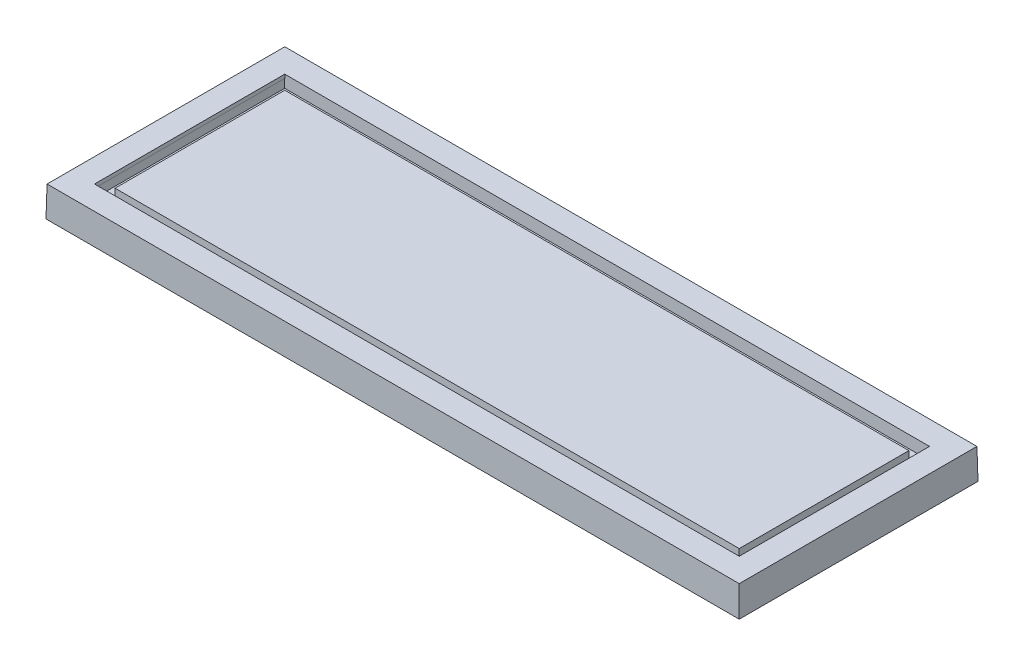
ISO-10303-21;
HEADER;
FILE_DESCRIPTION(('STEP AP214'),'2;1');
FILE_NAME('part.step','',(''),(''),'','','');
FILE_SCHEMA(('AUTOMOTIVE_DESIGN { 1 0 10303 214 1 1 1 1 }'));
ENDSEC;
DATA;
#1=APPLICATION_CONTEXT('core data for automotive mechanical design processes');
#2=APPLICATION_PROTOCOL_DEFINITION('international standard','automotive_design',2000,#1);
#3=PRODUCT_CONTEXT('',#1,'mechanical');
#4=PRODUCT('Part','Part','',(#3));
#5=PRODUCT_RELATED_PRODUCT_CATEGORY('part','',(#4));
#6=PRODUCT_DEFINITION_FORMATION('','',#4);
#7=PRODUCT_DEFINITION_CONTEXT('part definition',#1,'design');
#8=PRODUCT_DEFINITION('design','',#6,#7);
#9=PRODUCT_DEFINITION_SHAPE('','',#8);
#10=(LENGTH_UNIT() NAMED_UNIT(*) SI_UNIT(.MILLI.,.METRE.));
#11=(NAMED_UNIT(*) PLANE_ANGLE_UNIT() SI_UNIT($,.RADIAN.));
#12=(NAMED_UNIT(*) SI_UNIT($,.STERADIAN.) SOLID_ANGLE_UNIT());
#13=UNCERTAINTY_MEASURE_WITH_UNIT(LENGTH_MEASURE(1.E-05),#10,'distance_accuracy_value','');
#14=(GEOMETRIC_REPRESENTATION_CONTEXT(3) GLOBAL_UNCERTAINTY_ASSIGNED_CONTEXT((#13)) GLOBAL_UNIT_ASSIGNED_CONTEXT((#10,
#11,#12)) REPRESENTATION_CONTEXT('',''));
#15=CARTESIAN_POINT('',(0.,0.,0.));
#16=DIRECTION('',(0.,0.,1.));
#17=DIRECTION('',(1.,0.,0.));
#18=AXIS2_PLACEMENT_3D('',#15,#16,#17);
#19=CARTESIAN_POINT('',(286.,0.,98.5));
#20=DIRECTION('',(0.999847695156391,0.0174524064372835,0.));
#21=DIRECTION('',(-0.0174524064372836,0.999847695156391,0.));
#22=AXIS2_PLACEMENT_3D('',#19,#20,#21);
#23=PLANE('',#22);
#24=DIRECTION('',(0.,0.,-1.));
#25=VECTOR('',#24,1.);
#26=CARTESIAN_POINT('',(286.,0.,98.5));
#27=LINE('',#26,#25);
#28=CARTESIAN_POINT('',(286.,0.,98.5));
#29=VERTEX_POINT('',#28);
#30=CARTESIAN_POINT('',(286.,0.,-98.5));
#31=VERTEX_POINT('',#30);
#32=EDGE_CURVE('E243',#29,#31,#27,.T.);
#33=ORIENTED_EDGE('',*,*,#32,.T.);
#34=DIRECTION('',(0.0174497491606827,-0.999695459881888,-0.0174497491606827));
#35=VECTOR('',#34,1.);
#36=CARTESIAN_POINT('',(285.825829577419,9.97821682687104,-98.3258295774191));
#37=LINE('',#36,#35);
#38=CARTESIAN_POINT('',(285.563623376795,25.,-98.0636233767945));
#39=VERTEX_POINT('',#38);
#40=EDGE_CURVE('E11',#39,#31,#37,.T.);
#41=ORIENTED_EDGE('',*,*,#40,.F.);
#42=DIRECTION('',(0.,0.,1.));
#43=VECTOR('',#42,1.);
#44=CARTESIAN_POINT('',(285.563623376795,25.,0.));
#45=LINE('',#44,#43);
#46=CARTESIAN_POINT('',(285.563623376795,25.,98.0636233767946));
#47=VERTEX_POINT('',#46);
#48=EDGE_CURVE('E260',#47,#39,#45,.F.);
#49=ORIENTED_EDGE('',*,*,#48,.F.);
#50=DIRECTION('',(0.0174497491606827,-0.999695459881888,0.0174497491606827));
#51=VECTOR('',#50,1.);
#52=CARTESIAN_POINT('',(286.,0.,98.5));
#53=LINE('',#52,#51);
#54=EDGE_CURVE('E262',#47,#29,#53,.T.);
#55=ORIENTED_EDGE('',*,*,#54,.T.);
#56=EDGE_LOOP('',(#33,#41,#49,#55));
#57=FACE_BOUND('',#56,.T.);
#58=ADVANCED_FACE('F39',(#57),#23,.T.);
#59=CARTESIAN_POINT('',(-286.,0.,-98.5));
#60=DIRECTION('',(0.,0.0174524064372835,-0.999847695156391));
#61=DIRECTION('',(0.,0.999847695156391,0.0174524064372835));
#62=AXIS2_PLACEMENT_3D('',#59,#60,#61);
#63=PLANE('',#62);
#64=DIRECTION('',(-1.,0.,0.));
#65=VECTOR('',#64,1.);
#66=CARTESIAN_POINT('',(-286.,0.,-98.5));
#67=LINE('',#66,#65);
#68=CARTESIAN_POINT('',(-286.,0.,-98.5));
#69=VERTEX_POINT('',#68);
#70=EDGE_CURVE('E255',#31,#69,#67,.T.);
#71=ORIENTED_EDGE('',*,*,#70,.T.);
#72=DIRECTION('',(-0.0174497491606827,-0.999695459881888,-0.0174497491606827));
#73=VECTOR('',#72,1.);
#74=CARTESIAN_POINT('',(-285.940014732083,3.43655369736642,-98.4400147320831));
#75=LINE('',#74,#73);
#76=CARTESIAN_POINT('',(-285.563623376795,25.,-98.0636233767945));
#77=VERTEX_POINT('',#76);
#78=EDGE_CURVE('E48',#77,#69,#75,.T.);
#79=ORIENTED_EDGE('',*,*,#78,.F.);
#80=DIRECTION('',(1.,0.,0.));
#81=VECTOR('',#80,1.);
#82=CARTESIAN_POINT('',(0.,25.,-98.0636233767945));
#83=LINE('',#82,#81);
#84=EDGE_CURVE('E272',#39,#77,#83,.F.);
#85=ORIENTED_EDGE('',*,*,#84,.F.);
#86=ORIENTED_EDGE('',*,*,#40,.T.);
#87=EDGE_LOOP('',(#71,#79,#85,#86));
#88=FACE_BOUND('',#87,.T.);
#89=ADVANCED_FACE('F41',(#88),#63,.T.);
#90=CARTESIAN_POINT('',(-286.,0.,98.5));
#91=DIRECTION('',(-0.999847695156391,0.0174524064372835,0.));
#92=DIRECTION('',(-0.0174524064372836,-0.999847695156391,0.));
#93=AXIS2_PLACEMENT_3D('',#90,#91,#92);
#94=PLANE('',#93);
#95=DIRECTION('',(0.,0.,1.));
#96=VECTOR('',#95,1.);
#97=CARTESIAN_POINT('',(-286.,0.,98.5));
#98=LINE('',#97,#96);
#99=CARTESIAN_POINT('',(-286.,0.,98.5));
#100=VERTEX_POINT('',#99);
#101=EDGE_CURVE('E257',#69,#100,#98,.T.);
#102=ORIENTED_EDGE('',*,*,#101,.T.);
#103=DIRECTION('',(-0.0174497491606827,-0.999695459881888,0.0174497491606827));
#104=VECTOR('',#103,1.);
#105=CARTESIAN_POINT('',(-286.,0.,98.5));
#106=LINE('',#105,#104);
#107=CARTESIAN_POINT('',(-285.563623376795,25.,98.0636233767946));
#108=VERTEX_POINT('',#107);
#109=EDGE_CURVE('E265',#108,#100,#106,.T.);
#110=ORIENTED_EDGE('',*,*,#109,.F.);
#111=DIRECTION('',(0.,0.,-1.));
#112=VECTOR('',#111,1.);
#113=CARTESIAN_POINT('',(-285.563623376795,25.,0.));
#114=LINE('',#113,#112);
#115=EDGE_CURVE('E273',#77,#108,#114,.F.);
#116=ORIENTED_EDGE('',*,*,#115,.F.);
#117=ORIENTED_EDGE('',*,*,#78,.T.);
#118=EDGE_LOOP('',(#102,#110,#116,#117));
#119=FACE_BOUND('',#118,.T.);
#120=ADVANCED_FACE('F291',(#119),#94,.T.);
#121=CARTESIAN_POINT('',(-286.,0.,98.5));
#122=DIRECTION('',(0.,0.0174524064372835,0.999847695156391));
#123=DIRECTION('',(0.,-0.999847695156391,0.0174524064372835));
#124=AXIS2_PLACEMENT_3D('',#121,#122,#123);
#125=PLANE('',#124);
#126=DIRECTION('',(1.,0.,0.));
#127=VECTOR('',#126,1.);
#128=CARTESIAN_POINT('',(-286.,0.,98.5));
#129=LINE('',#128,#127);
#130=EDGE_CURVE('E259',#100,#29,#129,.T.);
#131=ORIENTED_EDGE('',*,*,#130,.T.);
#132=ORIENTED_EDGE('',*,*,#54,.F.);
#133=DIRECTION('',(-1.,0.,0.));
#134=VECTOR('',#133,1.);
#135=CARTESIAN_POINT('',(0.,25.,98.0636233767946));
#136=LINE('',#135,#134);
#137=EDGE_CURVE('E43',#108,#47,#136,.F.);
#138=ORIENTED_EDGE('',*,*,#137,.F.);
#139=ORIENTED_EDGE('',*,*,#109,.T.);
#140=EDGE_LOOP('',(#131,#132,#138,#139));
#141=FACE_BOUND('',#140,.T.);
#142=ADVANCED_FACE('F283',(#141),#125,.T.);
#143=CARTESIAN_POINT('',(0.,25.,0.));
#144=DIRECTION('',(0.,-1.,0.));
#145=DIRECTION('',(0.,0.,-1.));
#146=AXIS2_PLACEMENT_3D('',#143,#144,#145);
#147=PLANE('',#146);
#148=DIRECTION('',(-1.,0.,0.));
#149=VECTOR('',#148,1.);
#150=CARTESIAN_POINT('',(-266.,25.,-78.5));
#151=LINE('',#150,#149);
#152=CARTESIAN_POINT('',(266.,25.,-78.5));
#153=VERTEX_POINT('',#152);
#154=CARTESIAN_POINT('',(-266.,25.,-78.5));
#155=VERTEX_POINT('',#154);
#156=EDGE_CURVE('E231',#153,#155,#151,.T.);
#157=ORIENTED_EDGE('',*,*,#156,.F.);
#158=DIRECTION('',(0.,0.,-1.));
#159=VECTOR('',#158,1.);
#160=CARTESIAN_POINT('',(266.,25.,78.5));
#161=LINE('',#160,#159);
#162=CARTESIAN_POINT('',(266.,25.,78.5));
#163=VERTEX_POINT('',#162);
#164=EDGE_CURVE('E64',#163,#153,#161,.T.);
#165=ORIENTED_EDGE('',*,*,#164,.F.);
#166=DIRECTION('',(1.,0.,0.));
#167=VECTOR('',#166,1.);
#168=CARTESIAN_POINT('',(-266.,25.,78.5));
#169=LINE('',#168,#167);
#170=CARTESIAN_POINT('',(-266.,25.,78.5));
#171=VERTEX_POINT('',#170);
#172=EDGE_CURVE('E237',#171,#163,#169,.T.);
#173=ORIENTED_EDGE('',*,*,#172,.F.);
#174=DIRECTION('',(0.,0.,1.));
#175=VECTOR('',#174,1.);
#176=CARTESIAN_POINT('',(-266.,25.,78.5));
#177=LINE('',#176,#175);
#178=EDGE_CURVE('E234',#155,#171,#177,.T.);
#179=ORIENTED_EDGE('',*,*,#178,.F.);
#180=EDGE_LOOP('',(#157,#165,#173,#179));
#181=FACE_BOUND('',#180,.T.);
#182=ORIENTED_EDGE('',*,*,#48,.T.);
#183=ORIENTED_EDGE('',*,*,#84,.T.);
#184=ORIENTED_EDGE('',*,*,#115,.T.);
#185=ORIENTED_EDGE('',*,*,#137,.T.);
#186=EDGE_LOOP('',(#182,#183,#184,#185));
#187=FACE_BOUND('',#186,.T.);
#188=ADVANCED_FACE('F279',(#181,#187),#147,.F.);
#189=CARTESIAN_POINT('',(0.,0.,0.));
#190=DIRECTION('',(0.,-1.,0.));
#191=DIRECTION('',(0.,0.,-1.));
#192=AXIS2_PLACEMENT_3D('',#189,#190,#191);
#193=PLANE('',#192);
#194=ORIENTED_EDGE('',*,*,#32,.F.);
#195=ORIENTED_EDGE('',*,*,#130,.F.);
#196=ORIENTED_EDGE('',*,*,#101,.F.);
#197=ORIENTED_EDGE('',*,*,#70,.F.);
#198=EDGE_LOOP('',(#194,#195,#196,#197));
#199=FACE_BOUND('',#198,.T.);
#200=ADVANCED_FACE('F293',(#199),#193,.T.);
#201=CARTESIAN_POINT('',(266.,25.,78.5));
#202=DIRECTION('',(0.999847695156391,-0.0174524064372835,0.));
#203=DIRECTION('',(0.0174524064372835,0.999847695156391,0.));
#204=AXIS2_PLACEMENT_3D('',#201,#202,#203);
#205=PLANE('',#204);
#206=ORIENTED_EDGE('',*,*,#164,.T.);
#207=DIRECTION('',(0.0174497491606827,0.999695459881887,-0.0174497491606827));
#208=VECTOR('',#207,1.);
#209=CARTESIAN_POINT('',(265.952194481914,22.2612237031141,-78.452194481914));
#210=LINE('',#209,#208);
#211=CARTESIAN_POINT('',(265.947634805215,22.,-78.4476348052154));
#212=VERTEX_POINT('',#211);
#213=EDGE_CURVE('E245',#212,#153,#210,.T.);
#214=ORIENTED_EDGE('',*,*,#213,.F.);
#215=DIRECTION('',(0.,0.,-1.));
#216=VECTOR('',#215,1.);
#217=CARTESIAN_POINT('',(265.947634805215,22.,78.5));
#218=LINE('',#217,#216);
#219=CARTESIAN_POINT('',(265.947634805215,22.,78.4476348052154));
#220=VERTEX_POINT('',#219);
#221=EDGE_CURVE('E240',#220,#212,#218,.T.);
#222=ORIENTED_EDGE('',*,*,#221,.F.);
#223=DIRECTION('',(0.0174497491606827,0.999695459881887,0.0174497491606827));
#224=VECTOR('',#223,1.);
#225=CARTESIAN_POINT('',(265.83800932725,15.7195605736095,78.3380093272499));
#226=LINE('',#225,#224);
#227=EDGE_CURVE('E241',#220,#163,#226,.T.);
#228=ORIENTED_EDGE('',*,*,#227,.T.);
#229=EDGE_LOOP('',(#206,#214,#222,#228));
#230=FACE_BOUND('',#229,.T.);
#231=ADVANCED_FACE('F295',(#230),#205,.F.);
#232=CARTESIAN_POINT('',(-266.,25.,78.5));
#233=DIRECTION('',(0.,-0.0174524064372835,0.999847695156391));
#234=DIRECTION('',(0.,-0.999847695156391,-0.0174524064372835));
#235=AXIS2_PLACEMENT_3D('',#232,#233,#234);
#236=PLANE('',#235);
#237=ORIENTED_EDGE('',*,*,#172,.T.);
#238=ORIENTED_EDGE('',*,*,#227,.F.);
#239=DIRECTION('',(1.,0.,0.));
#240=VECTOR('',#239,1.);
#241=CARTESIAN_POINT('',(-266.,22.,78.4476348052154));
#242=LINE('',#241,#240);
#243=CARTESIAN_POINT('',(266.,22.,78.4476348052154));
#244=VERTEX_POINT('',#243);
#245=EDGE_CURVE('E193',#220,#244,#242,.T.);
#246=ORIENTED_EDGE('',*,*,#245,.T.);
#247=DIRECTION('',(0.0174497491606827,0.999695459881888,0.0174497491606827));
#248=VECTOR('',#247,1.);
#249=CARTESIAN_POINT('',(265.83800932725,12.7195605736095,78.2856441324653));
#250=LINE('',#249,#248);
#251=CARTESIAN_POINT('',(265.877814545502,15.,78.3254493507178));
#252=VERTEX_POINT('',#251);
#253=EDGE_CURVE('E209',#252,#244,#250,.T.);
#254=ORIENTED_EDGE('',*,*,#253,.F.);
#255=DIRECTION('',(1.,0.,0.));
#256=VECTOR('',#255,1.);
#257=CARTESIAN_POINT('',(-266.,15.,78.3254493507178));
#258=LINE('',#257,#256);
#259=CARTESIAN_POINT('',(-265.877814545503,15.,78.3254493507178));
#260=VERTEX_POINT('',#259);
#261=EDGE_CURVE('E216',#260,#252,#258,.T.);
#262=ORIENTED_EDGE('',*,*,#261,.F.);
#263=DIRECTION('',(-0.0174497491606827,0.999695459881888,0.0174497491606827));
#264=VECTOR('',#263,1.);
#265=CARTESIAN_POINT('',(-266.,22.,78.4476348052154));
#266=LINE('',#265,#264);
#267=CARTESIAN_POINT('',(-266.,22.,78.4476348052154));
#268=VERTEX_POINT('',#267);
#269=EDGE_CURVE('E212',#260,#268,#266,.T.);
#270=ORIENTED_EDGE('',*,*,#269,.T.);
#271=CARTESIAN_POINT('',(-265.947634805215,22.,78.4476348052154));
#272=VERTEX_POINT('',#271);
#273=EDGE_CURVE('E194',#268,#272,#242,.T.);
#274=ORIENTED_EDGE('',*,*,#273,.T.);
#275=DIRECTION('',(-0.0174497491606827,0.999695459881887,0.0174497491606827));
#276=VECTOR('',#275,1.);
#277=CARTESIAN_POINT('',(-266.,25.,78.5));
#278=LINE('',#277,#276);
#279=EDGE_CURVE('E244',#272,#171,#278,.T.);
#280=ORIENTED_EDGE('',*,*,#279,.T.);
#281=EDGE_LOOP('',(#237,#238,#246,#254,#262,#270,#274,#280));
#282=FACE_BOUND('',#281,.T.);
#283=ADVANCED_FACE('F302',(#282),#236,.F.);
#284=CARTESIAN_POINT('',(-266.,25.,78.5));
#285=DIRECTION('',(-0.999847695156391,-0.0174524064372835,0.));
#286=DIRECTION('',(0.0174524064372835,-0.999847695156391,0.));
#287=AXIS2_PLACEMENT_3D('',#284,#285,#286);
#288=PLANE('',#287);
#289=ORIENTED_EDGE('',*,*,#178,.T.);
#290=ORIENTED_EDGE('',*,*,#279,.F.);
#291=DIRECTION('',(0.,0.,1.));
#292=VECTOR('',#291,1.);
#293=CARTESIAN_POINT('',(-265.947634805215,22.,78.5));
#294=LINE('',#293,#292);
#295=CARTESIAN_POINT('',(-265.947634805215,22.,-78.4476348052154));
#296=VERTEX_POINT('',#295);
#297=EDGE_CURVE('E248',#296,#272,#294,.T.);
#298=ORIENTED_EDGE('',*,*,#297,.F.);
#299=DIRECTION('',(-0.0174497491606827,0.999695459881887,-0.0174497491606827));
#300=VECTOR('',#299,1.);
#301=CARTESIAN_POINT('',(-266.,25.,-78.5));
#302=LINE('',#301,#300);
#303=EDGE_CURVE('E247',#296,#155,#302,.T.);
#304=ORIENTED_EDGE('',*,*,#303,.T.);
#305=EDGE_LOOP('',(#289,#290,#298,#304));
#306=FACE_BOUND('',#305,.T.);
#307=ADVANCED_FACE('F349',(#306),#288,.F.);
#308=CARTESIAN_POINT('',(-266.,25.,-78.5));
#309=DIRECTION('',(0.,-0.0174524064372835,-0.999847695156391));
#310=DIRECTION('',(0.,0.999847695156391,-0.0174524064372835));
#311=AXIS2_PLACEMENT_3D('',#308,#309,#310);
#312=PLANE('',#311);
#313=ORIENTED_EDGE('',*,*,#156,.T.);
#314=ORIENTED_EDGE('',*,*,#303,.F.);
#315=DIRECTION('',(-1.,0.,0.));
#316=VECTOR('',#315,1.);
#317=CARTESIAN_POINT('',(-266.,22.,-78.4476348052154));
#318=LINE('',#317,#316);
#319=CARTESIAN_POINT('',(-266.,22.,-78.4476348052154));
#320=VERTEX_POINT('',#319);
#321=EDGE_CURVE('E185',#296,#320,#318,.T.);
#322=ORIENTED_EDGE('',*,*,#321,.T.);
#323=DIRECTION('',(-0.0174497491606827,0.999695459881888,-0.0174497491606827));
#324=VECTOR('',#323,1.);
#325=CARTESIAN_POINT('',(-266.,22.,-78.4476348052154));
#326=LINE('',#325,#324);
#327=CARTESIAN_POINT('',(-265.877814545503,15.,-78.3254493507178));
#328=VERTEX_POINT('',#327);
#329=EDGE_CURVE('E215',#328,#320,#326,.T.);
#330=ORIENTED_EDGE('',*,*,#329,.F.);
#331=DIRECTION('',(-1.,0.,0.));
#332=VECTOR('',#331,1.);
#333=CARTESIAN_POINT('',(-266.,15.,-78.3254493507178));
#334=LINE('',#333,#332);
#335=CARTESIAN_POINT('',(265.877814545502,15.,-78.3254493507178));
#336=VERTEX_POINT('',#335);
#337=EDGE_CURVE('E222',#336,#328,#334,.T.);
#338=ORIENTED_EDGE('',*,*,#337,.F.);
#339=DIRECTION('',(0.0174497491606827,0.999695459881888,-0.0174497491606827));
#340=VECTOR('',#339,1.);
#341=CARTESIAN_POINT('',(265.952226371663,19.2630506655887,-78.3998611768779));
#342=LINE('',#341,#340);
#343=CARTESIAN_POINT('',(266.,22.,-78.4476348052154));
#344=VERTEX_POINT('',#343);
#345=EDGE_CURVE('E213',#336,#344,#342,.T.);
#346=ORIENTED_EDGE('',*,*,#345,.T.);
#347=EDGE_CURVE('E187',#344,#212,#318,.T.);
#348=ORIENTED_EDGE('',*,*,#347,.T.);
#349=ORIENTED_EDGE('',*,*,#213,.T.);
#350=EDGE_LOOP('',(#313,#314,#322,#330,#338,#346,#348,#349));
#351=FACE_BOUND('',#350,.T.);
#352=ADVANCED_FACE('F362',(#351),#312,.F.);
#353=CARTESIAN_POINT('',(0.,22.,0.));
#354=DIRECTION('',(0.,-1.,0.));
#355=DIRECTION('',(0.,0.,-1.));
#356=AXIS2_PLACEMENT_3D('',#353,#354,#355);
#357=PLANE('',#356);
#358=ORIENTED_EDGE('',*,*,#221,.T.);
#359=ORIENTED_EDGE('',*,*,#347,.F.);
#360=DIRECTION('',(0.,0.,-1.));
#361=VECTOR('',#360,1.);
#362=CARTESIAN_POINT('',(266.,22.,78.4476348052154));
#363=LINE('',#362,#361);
#364=EDGE_CURVE('E182',#244,#344,#363,.T.);
#365=ORIENTED_EDGE('',*,*,#364,.F.);
#366=ORIENTED_EDGE('',*,*,#245,.F.);
#367=EDGE_LOOP('',(#358,#359,#365,#366));
#368=FACE_BOUND('',#367,.T.);
#369=ADVANCED_FACE('F371',(#368),#357,.T.);
#370=ORIENTED_EDGE('',*,*,#297,.T.);
#371=ORIENTED_EDGE('',*,*,#273,.F.);
#372=DIRECTION('',(0.,0.,1.));
#373=VECTOR('',#372,1.);
#374=CARTESIAN_POINT('',(-266.,22.,78.4476348052154));
#375=LINE('',#374,#373);
#376=EDGE_CURVE('E190',#320,#268,#375,.T.);
#377=ORIENTED_EDGE('',*,*,#376,.F.);
#378=ORIENTED_EDGE('',*,*,#321,.F.);
#379=EDGE_LOOP('',(#370,#371,#377,#378));
#380=FACE_BOUND('',#379,.T.);
#381=ADVANCED_FACE('F440',(#380),#357,.T.);
#382=CARTESIAN_POINT('',(266.,22.,78.4476348052154));
#383=DIRECTION('',(0.999847695156391,-0.0174524064372835,0.));
#384=DIRECTION('',(0.0174524064372836,0.999847695156391,0.));
#385=AXIS2_PLACEMENT_3D('',#382,#383,#384);
#386=PLANE('',#385);
#387=ORIENTED_EDGE('',*,*,#364,.T.);
#388=ORIENTED_EDGE('',*,*,#345,.F.);
#389=DIRECTION('',(0.,0.,-1.));
#390=VECTOR('',#389,1.);
#391=CARTESIAN_POINT('',(265.877814545502,15.,78.4476348052154));
#392=LINE('',#391,#390);
#393=EDGE_CURVE('E196',#252,#336,#392,.T.);
#394=ORIENTED_EDGE('',*,*,#393,.F.);
#395=ORIENTED_EDGE('',*,*,#253,.T.);
#396=EDGE_LOOP('',(#387,#388,#394,#395));
#397=FACE_BOUND('',#396,.T.);
#398=ADVANCED_FACE('F431',(#397),#386,.F.);
#399=CARTESIAN_POINT('',(-266.,22.,78.4476348052154));
#400=DIRECTION('',(-0.999847695156391,-0.0174524064372835,0.));
#401=DIRECTION('',(0.0174524064372836,-0.999847695156391,0.));
#402=AXIS2_PLACEMENT_3D('',#399,#400,#401);
#403=PLANE('',#402);
#404=ORIENTED_EDGE('',*,*,#376,.T.);
#405=ORIENTED_EDGE('',*,*,#269,.F.);
#406=DIRECTION('',(0.,0.,1.));
#407=VECTOR('',#406,1.);
#408=CARTESIAN_POINT('',(-265.877814545503,15.,78.4476348052154));
#409=LINE('',#408,#407);
#410=EDGE_CURVE('E225',#328,#260,#409,.T.);
#411=ORIENTED_EDGE('',*,*,#410,.F.);
#412=ORIENTED_EDGE('',*,*,#329,.T.);
#413=EDGE_LOOP('',(#404,#405,#411,#412));
#414=FACE_BOUND('',#413,.T.);
#415=ADVANCED_FACE('F422',(#414),#403,.F.);
#416=CARTESIAN_POINT('',(0.,15.,0.));
#417=DIRECTION('',(0.,-1.,0.));
#418=DIRECTION('',(0.,0.,-1.));
#419=AXIS2_PLACEMENT_3D('',#416,#417,#418);
#420=PLANE('',#419);
#421=DIRECTION('',(0.,0.,1.));
#422=VECTOR('',#421,1.);
#423=CARTESIAN_POINT('',(257.622185454498,15.,69.9999999999998));
#424=LINE('',#423,#422);
#425=CARTESIAN_POINT('',(257.622185454498,15.,70.1221854544974));
#426=VERTEX_POINT('',#425);
#427=CARTESIAN_POINT('',(257.622185454498,15.,-70.1221854544975));
#428=VERTEX_POINT('',#427);
#429=EDGE_CURVE('E181',#426,#428,#424,.F.);
#430=ORIENTED_EDGE('',*,*,#429,.F.);
#431=DIRECTION('',(-1.,0.,0.));
#432=VECTOR('',#431,1.);
#433=CARTESIAN_POINT('',(-257.5,15.,70.1221854544976));
#434=LINE('',#433,#432);
#435=CARTESIAN_POINT('',(-257.622185454498,15.,70.1221854544976));
#436=VERTEX_POINT('',#435);
#437=EDGE_CURVE('E199',#436,#426,#434,.F.);
#438=ORIENTED_EDGE('',*,*,#437,.F.);
#439=DIRECTION('',(0.,0.,-1.));
#440=VECTOR('',#439,1.);
#441=CARTESIAN_POINT('',(-257.622185454498,15.,70.));
#442=LINE('',#441,#440);
#443=CARTESIAN_POINT('',(-257.622185454498,15.,-70.1221854544976));
#444=VERTEX_POINT('',#443);
#445=EDGE_CURVE('E203',#444,#436,#442,.F.);
#446=ORIENTED_EDGE('',*,*,#445,.F.);
#447=DIRECTION('',(1.,0.,0.));
#448=VECTOR('',#447,1.);
#449=CARTESIAN_POINT('',(-257.5,15.,-70.1221854544976));
#450=LINE('',#449,#448);
#451=EDGE_CURVE('E163',#428,#444,#450,.F.);
#452=ORIENTED_EDGE('',*,*,#451,.F.);
#453=EDGE_LOOP('',(#430,#438,#446,#452));
#454=FACE_BOUND('',#453,.T.);
#455=ORIENTED_EDGE('',*,*,#393,.T.);
#456=ORIENTED_EDGE('',*,*,#337,.T.);
#457=ORIENTED_EDGE('',*,*,#410,.T.);
#458=ORIENTED_EDGE('',*,*,#261,.T.);
#459=EDGE_LOOP('',(#455,#456,#457,#458));
#460=FACE_BOUND('',#459,.T.);
#461=ADVANCED_FACE('F413',(#454,#460),#420,.F.);
#462=CARTESIAN_POINT('',(257.5,22.,69.9999999999998));
#463=DIRECTION('',(-0.999847695156391,-0.0174524064372835,0.));
#464=DIRECTION('',(0.0174524064372835,-0.999847695156391,0.));
#465=AXIS2_PLACEMENT_3D('',#462,#463,#464);
#466=PLANE('',#465);
#467=DIRECTION('',(0.,0.,-1.));
#468=VECTOR('',#467,1.);
#469=CARTESIAN_POINT('',(257.5,22.,69.9999999999998));
#470=LINE('',#469,#468);
#471=CARTESIAN_POINT('',(257.5,22.,69.9999999999998));
#472=VERTEX_POINT('',#471);
#473=CARTESIAN_POINT('',(257.5,22.,-70.));
#474=VERTEX_POINT('',#473);
#475=EDGE_CURVE('E176',#472,#474,#470,.T.);
#476=ORIENTED_EDGE('',*,*,#475,.F.);
#477=DIRECTION('',(-0.0174497491606827,0.999695459881887,-0.0174497491606827));
#478=VECTOR('',#477,1.);
#479=CARTESIAN_POINT('',(257.343185720928,30.9838840311863,69.8431857209279));
#480=LINE('',#479,#478);
#481=EDGE_CURVE('E186',#426,#472,#480,.T.);
#482=ORIENTED_EDGE('',*,*,#481,.F.);
#483=ORIENTED_EDGE('',*,*,#429,.T.);
#484=DIRECTION('',(-0.0174497491606827,0.999695459881887,0.0174497491606827));
#485=VECTOR('',#484,1.);
#486=CARTESIAN_POINT('',(257.457370875592,24.4422209016817,-69.9573708755921));
#487=LINE('',#486,#485);
#488=EDGE_CURVE('E167',#428,#474,#487,.T.);
#489=ORIENTED_EDGE('',*,*,#488,.T.);
#490=EDGE_LOOP('',(#476,#482,#483,#489));
#491=FACE_BOUND('',#490,.T.);
#492=ADVANCED_FACE('F405',(#491),#466,.F.);
#493=CARTESIAN_POINT('',(-257.5,22.,70.));
#494=DIRECTION('',(0.,-0.0174524064372835,-0.999847695156391));
#495=DIRECTION('',(0.,0.999847695156391,-0.0174524064372835));
#496=AXIS2_PLACEMENT_3D('',#493,#494,#495);
#497=PLANE('',#496);
#498=DIRECTION('',(1.,0.,0.));
#499=VECTOR('',#498,1.);
#500=CARTESIAN_POINT('',(-257.5,22.,70.));
#501=LINE('',#500,#499);
#502=CARTESIAN_POINT('',(-257.5,22.,70.));
#503=VERTEX_POINT('',#502);
#504=EDGE_CURVE('E56',#503,#472,#501,.T.);
#505=ORIENTED_EDGE('',*,*,#504,.F.);
#506=DIRECTION('',(0.0174497491606827,0.999695459881887,-0.0174497491606827));
#507=VECTOR('',#506,1.);
#508=CARTESIAN_POINT('',(-257.5,22.,70.));
#509=LINE('',#508,#507);
#510=EDGE_CURVE('E166',#436,#503,#509,.T.);
#511=ORIENTED_EDGE('',*,*,#510,.F.);
#512=ORIENTED_EDGE('',*,*,#437,.T.);
#513=ORIENTED_EDGE('',*,*,#481,.T.);
#514=EDGE_LOOP('',(#505,#511,#512,#513));
#515=FACE_BOUND('',#514,.T.);
#516=ADVANCED_FACE('F397',(#515),#497,.F.);
#517=CARTESIAN_POINT('',(-257.5,22.,70.));
#518=DIRECTION('',(0.999847695156391,-0.0174524064372835,0.));
#519=DIRECTION('',(0.0174524064372835,0.999847695156391,0.));
#520=AXIS2_PLACEMENT_3D('',#517,#518,#519);
#521=PLANE('',#520);
#522=DIRECTION('',(0.,0.,1.));
#523=VECTOR('',#522,1.);
#524=CARTESIAN_POINT('',(-257.5,22.,70.));
#525=LINE('',#524,#523);
#526=CARTESIAN_POINT('',(-257.5,22.,-70.));
#527=VERTEX_POINT('',#526);
#528=EDGE_CURVE('E170',#527,#503,#525,.T.);
#529=ORIENTED_EDGE('',*,*,#528,.F.);
#530=DIRECTION('',(0.0174497491606827,0.999695459881887,0.0174497491606827));
#531=VECTOR('',#530,1.);
#532=CARTESIAN_POINT('',(-257.5,22.,-70.));
#533=LINE('',#532,#531);
#534=EDGE_CURVE('E156',#444,#527,#533,.T.);
#535=ORIENTED_EDGE('',*,*,#534,.F.);
#536=ORIENTED_EDGE('',*,*,#445,.T.);
#537=ORIENTED_EDGE('',*,*,#510,.T.);
#538=EDGE_LOOP('',(#529,#535,#536,#537));
#539=FACE_BOUND('',#538,.T.);
#540=ADVANCED_FACE('F171',(#539),#521,.F.);
#541=CARTESIAN_POINT('',(-257.5,22.,-70.));
#542=DIRECTION('',(0.,-0.0174524064372835,0.999847695156391));
#543=DIRECTION('',(0.,-0.999847695156391,-0.0174524064372835));
#544=AXIS2_PLACEMENT_3D('',#541,#542,#543);
#545=PLANE('',#544);
#546=DIRECTION('',(-1.,0.,0.));
#547=VECTOR('',#546,1.);
#548=CARTESIAN_POINT('',(-257.5,22.,-70.));
#549=LINE('',#548,#547);
#550=EDGE_CURVE('E160',#474,#527,#549,.T.);
#551=ORIENTED_EDGE('',*,*,#550,.F.);
#552=ORIENTED_EDGE('',*,*,#488,.F.);
#553=ORIENTED_EDGE('',*,*,#451,.T.);
#554=ORIENTED_EDGE('',*,*,#534,.T.);
#555=EDGE_LOOP('',(#551,#552,#553,#554));
#556=FACE_BOUND('',#555,.T.);
#557=ADVANCED_FACE('F158',(#556),#545,.F.);
#558=CARTESIAN_POINT('',(0.,22.,0.));
#559=DIRECTION('',(0.,-1.,0.));
#560=DIRECTION('',(0.,0.,-1.));
#561=AXIS2_PLACEMENT_3D('',#558,#559,#560);
#562=PLANE('',#561);
#563=ORIENTED_EDGE('',*,*,#475,.T.);
#564=ORIENTED_EDGE('',*,*,#550,.T.);
#565=ORIENTED_EDGE('',*,*,#528,.T.);
#566=ORIENTED_EDGE('',*,*,#504,.T.);
#567=EDGE_LOOP('',(#563,#564,#565,#566));
#568=FACE_BOUND('',#567,.T.);
#569=ADVANCED_FACE('F174',(#568),#562,.F.);
#570=CLOSED_SHELL('',(#58,#89,#120,#142,#188,#200,#231,#283,#307,#352,#369,#381,#398,#415,#461,
#492,#516,#540,#557,#569));
#571=MANIFOLD_SOLID_BREP('B2',#570);
#572=ADVANCED_BREP_SHAPE_REPRESENTATION('',(#18,#571),#14);
#573=SHAPE_DEFINITION_REPRESENTATION(#9,#572);
ENDSEC;
END-ISO-10303-21;
